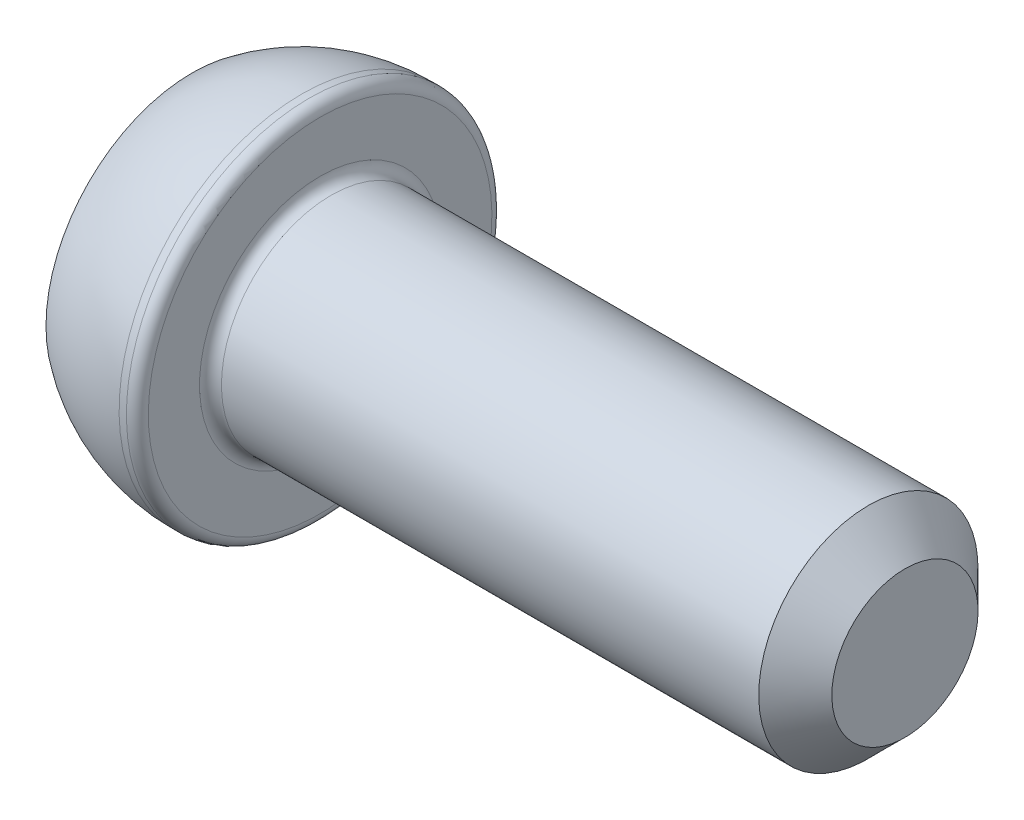
ISO-10303-21;
HEADER;
FILE_DESCRIPTION(('STEP AP214'),'2;1');
FILE_NAME('part.step','',(''),(''),'','','');
FILE_SCHEMA(('AUTOMOTIVE_DESIGN { 1 0 10303 214 1 1 1 1 }'));
ENDSEC;
DATA;
#1=APPLICATION_CONTEXT('core data for automotive mechanical design processes');
#2=APPLICATION_PROTOCOL_DEFINITION('international standard','automotive_design',2000,#1);
#3=PRODUCT_CONTEXT('',#1,'mechanical');
#4=PRODUCT('Part','Part','',(#3));
#5=PRODUCT_RELATED_PRODUCT_CATEGORY('part','',(#4));
#6=PRODUCT_DEFINITION_FORMATION('','',#4);
#7=PRODUCT_DEFINITION_CONTEXT('part definition',#1,'design');
#8=PRODUCT_DEFINITION('design','',#6,#7);
#9=PRODUCT_DEFINITION_SHAPE('','',#8);
#10=(LENGTH_UNIT() NAMED_UNIT(*) SI_UNIT(.MILLI.,.METRE.));
#11=(NAMED_UNIT(*) PLANE_ANGLE_UNIT() SI_UNIT($,.RADIAN.));
#12=(NAMED_UNIT(*) SI_UNIT($,.STERADIAN.) SOLID_ANGLE_UNIT());
#13=UNCERTAINTY_MEASURE_WITH_UNIT(LENGTH_MEASURE(1.E-05),#10,'distance_accuracy_value','');
#14=(GEOMETRIC_REPRESENTATION_CONTEXT(3) GLOBAL_UNCERTAINTY_ASSIGNED_CONTEXT((#13)) GLOBAL_UNIT_ASSIGNED_CONTEXT((#10,
#11,#12)) REPRESENTATION_CONTEXT('',''));
#15=CARTESIAN_POINT('',(0.,0.,0.));
#16=DIRECTION('',(0.,0.,1.));
#17=DIRECTION('',(1.,0.,0.));
#18=AXIS2_PLACEMENT_3D('',#15,#16,#17);
#19=CARTESIAN_POINT('',(0.,0.,0.));
#20=DIRECTION('',(-1.,0.,0.));
#21=DIRECTION('',(0.,-1.,0.));
#22=AXIS2_PLACEMENT_3D('',#19,#20,#21);
#23=PLANE('',#22);
#24=DIRECTION('',(0.,0.866025403784438,-0.5));
#25=VECTOR('',#24,1.);
#26=CARTESIAN_POINT('',(0.,0.,2.3094010767585));
#27=LINE('',#26,#25);
#28=CARTESIAN_POINT('',(0.,0.,2.3094010767585));
#29=VERTEX_POINT('',#28);
#30=CARTESIAN_POINT('',(0.,2.,1.15470053837925));
#31=VERTEX_POINT('',#30);
#32=EDGE_CURVE('E54',#29,#31,#27,.T.);
#33=ORIENTED_EDGE('',*,*,#32,.F.);
#34=DIRECTION('',(0.,0.866025403784439,0.5));
#35=VECTOR('',#34,1.);
#36=CARTESIAN_POINT('',(0.,-2.,1.15470053837925));
#37=LINE('',#36,#35);
#38=CARTESIAN_POINT('',(0.,-2.,1.15470053837925));
#39=VERTEX_POINT('',#38);
#40=EDGE_CURVE('E137',#39,#29,#37,.T.);
#41=ORIENTED_EDGE('',*,*,#40,.F.);
#42=DIRECTION('',(0.,0.,1.));
#43=VECTOR('',#42,1.);
#44=CARTESIAN_POINT('',(0.,-2.,-1.15470053837925));
#45=LINE('',#44,#43);
#46=CARTESIAN_POINT('',(0.,-2.,-1.15470053837925));
#47=VERTEX_POINT('',#46);
#48=EDGE_CURVE('E135',#47,#39,#45,.T.);
#49=ORIENTED_EDGE('',*,*,#48,.F.);
#50=DIRECTION('',(0.,-0.866025403784439,0.5));
#51=VECTOR('',#50,1.);
#52=CARTESIAN_POINT('',(0.,0.,-2.3094010767585));
#53=LINE('',#52,#51);
#54=CARTESIAN_POINT('',(0.,0.,-2.3094010767585));
#55=VERTEX_POINT('',#54);
#56=EDGE_CURVE('E102',#55,#47,#53,.T.);
#57=ORIENTED_EDGE('',*,*,#56,.F.);
#58=DIRECTION('',(0.,-0.866025403784439,-0.5));
#59=VECTOR('',#58,1.);
#60=CARTESIAN_POINT('',(0.,2.,-1.15470053837925));
#61=LINE('',#60,#59);
#62=CARTESIAN_POINT('',(0.,2.,-1.15470053837925));
#63=VERTEX_POINT('',#62);
#64=EDGE_CURVE('E131',#63,#55,#61,.T.);
#65=ORIENTED_EDGE('',*,*,#64,.F.);
#66=DIRECTION('',(0.,0.,-1.));
#67=VECTOR('',#66,1.);
#68=CARTESIAN_POINT('',(0.,2.,1.15470053837925));
#69=LINE('',#68,#67);
#70=EDGE_CURVE('E128',#31,#63,#69,.T.);
#71=ORIENTED_EDGE('',*,*,#70,.F.);
#72=EDGE_LOOP('',(#33,#41,#49,#57,#65,#71));
#73=FACE_BOUND('',#72,.T.);
#74=CARTESIAN_POINT('',(0.,0.,0.));
#75=DIRECTION('',(1.,0.,0.));
#76=DIRECTION('',(0.,1.,0.));
#77=AXIS2_PLACEMENT_3D('',#74,#75,#76);
#78=CIRCLE('',#77,4.);
#79=CARTESIAN_POINT('',(0.,4.,0.));
#80=VERTEX_POINT('',#79);
#81=EDGE_CURVE('E149',#80,#80,#78,.T.);
#82=ORIENTED_EDGE('',*,*,#81,.F.);
#83=EDGE_LOOP('',(#82));
#84=FACE_BOUND('',#83,.T.);
#85=ADVANCED_FACE('F38',(#73,#84),#23,.T.);
#86=CARTESIAN_POINT('',(3.,0.,0.));
#87=DIRECTION('',(1.,0.,0.));
#88=DIRECTION('',(0.,1.,0.));
#89=AXIS2_PLACEMENT_3D('',#86,#87,#88);
#90=SPHERICAL_SURFACE('',#89,5.);
#91=ORIENTED_EDGE('',*,*,#81,.T.);
#92=EDGE_LOOP('',(#91));
#93=FACE_BOUND('',#92,.T.);
#94=CARTESIAN_POINT('',(3.,0.,0.));
#95=DIRECTION('',(1.,0.,0.));
#96=DIRECTION('',(0.,1.,0.));
#97=AXIS2_PLACEMENT_3D('',#94,#95,#96);
#98=CIRCLE('',#97,5.);
#99=CARTESIAN_POINT('',(3.,5.,0.));
#100=VERTEX_POINT('',#99);
#101=EDGE_CURVE('E141',#100,#100,#98,.T.);
#102=ORIENTED_EDGE('',*,*,#101,.F.);
#103=EDGE_LOOP('',(#102));
#104=FACE_BOUND('',#103,.T.);
#105=ADVANCED_FACE('F178',(#93,#104),#90,.T.);
#106=CARTESIAN_POINT('',(19.5,0.,0.));
#107=DIRECTION('',(1.,0.,0.));
#108=DIRECTION('',(0.,1.,0.));
#109=AXIS2_PLACEMENT_3D('',#106,#107,#108);
#110=CYLINDRICAL_SURFACE('',#109,5.);
#111=CARTESIAN_POINT('',(3.2,0.,0.));
#112=DIRECTION('',(1.,0.,0.));
#113=DIRECTION('',(0.,1.,0.));
#114=AXIS2_PLACEMENT_3D('',#111,#112,#113);
#115=CIRCLE('',#114,5.);
#116=CARTESIAN_POINT('',(3.2,5.,0.));
#117=VERTEX_POINT('',#116);
#118=EDGE_CURVE('E161',#117,#117,#115,.F.);
#119=ORIENTED_EDGE('',*,*,#118,.T.);
#120=EDGE_LOOP('',(#119));
#121=FACE_BOUND('',#120,.T.);
#122=ORIENTED_EDGE('',*,*,#101,.T.);
#123=EDGE_LOOP('',(#122));
#124=FACE_BOUND('',#123,.T.);
#125=ADVANCED_FACE('F184',(#121,#124),#110,.T.);
#126=CARTESIAN_POINT('',(3.5,5.,0.));
#127=DIRECTION('',(1.,0.,0.));
#128=DIRECTION('',(0.,1.,0.));
#129=AXIS2_PLACEMENT_3D('',#126,#127,#128);
#130=PLANE('',#129);
#131=CARTESIAN_POINT('',(3.5,0.,0.));
#132=DIRECTION('',(1.,0.,0.));
#133=DIRECTION('',(0.,1.,0.));
#134=AXIS2_PLACEMENT_3D('',#131,#132,#133);
#135=CIRCLE('',#134,3.3);
#136=CARTESIAN_POINT('',(3.5,3.3,0.));
#137=VERTEX_POINT('',#136);
#138=EDGE_CURVE('E158',#137,#137,#135,.F.);
#139=ORIENTED_EDGE('',*,*,#138,.T.);
#140=EDGE_LOOP('',(#139));
#141=FACE_BOUND('',#140,.T.);
#142=CARTESIAN_POINT('',(3.5,0.,0.));
#143=DIRECTION('',(1.,0.,0.));
#144=DIRECTION('',(0.,1.,0.));
#145=AXIS2_PLACEMENT_3D('',#142,#143,#144);
#146=CIRCLE('',#145,4.7);
#147=CARTESIAN_POINT('',(3.5,4.7,0.));
#148=VERTEX_POINT('',#147);
#149=EDGE_CURVE('E155',#148,#148,#146,.T.);
#150=ORIENTED_EDGE('',*,*,#149,.T.);
#151=EDGE_LOOP('',(#150));
#152=FACE_BOUND('',#151,.T.);
#153=ADVANCED_FACE('F203',(#141,#152),#130,.T.);
#154=CARTESIAN_POINT('',(19.5,0.,0.));
#155=DIRECTION('',(1.,0.,0.));
#156=DIRECTION('',(0.,1.,0.));
#157=AXIS2_PLACEMENT_3D('',#154,#155,#156);
#158=CYLINDRICAL_SURFACE('',#157,3.);
#159=CARTESIAN_POINT('',(18.5,0.,0.));
#160=DIRECTION('',(1.,0.,0.));
#161=DIRECTION('',(0.,1.,0.));
#162=AXIS2_PLACEMENT_3D('',#159,#160,#161);
#163=CIRCLE('',#162,3.);
#164=CARTESIAN_POINT('',(18.5,3.,0.));
#165=VERTEX_POINT('',#164);
#166=EDGE_CURVE('E11',#165,#165,#163,.F.);
#167=ORIENTED_EDGE('',*,*,#166,.T.);
#168=EDGE_LOOP('',(#167));
#169=FACE_BOUND('',#168,.T.);
#170=CARTESIAN_POINT('',(3.8,0.,0.));
#171=DIRECTION('',(1.,0.,0.));
#172=DIRECTION('',(0.,1.,0.));
#173=AXIS2_PLACEMENT_3D('',#170,#171,#172);
#174=CIRCLE('',#173,3.);
#175=CARTESIAN_POINT('',(3.8,3.,0.));
#176=VERTEX_POINT('',#175);
#177=EDGE_CURVE('E152',#176,#176,#174,.T.);
#178=ORIENTED_EDGE('',*,*,#177,.T.);
#179=EDGE_LOOP('',(#178));
#180=FACE_BOUND('',#179,.T.);
#181=ADVANCED_FACE('F201',(#169,#180),#158,.T.);
#182=CARTESIAN_POINT('',(19.5,3.,0.));
#183=DIRECTION('',(1.,0.,0.));
#184=DIRECTION('',(0.,1.,0.));
#185=AXIS2_PLACEMENT_3D('',#182,#183,#184);
#186=PLANE('',#185);
#187=CARTESIAN_POINT('',(19.5,0.,0.));
#188=DIRECTION('',(1.,0.,0.));
#189=DIRECTION('',(0.,1.,0.));
#190=AXIS2_PLACEMENT_3D('',#187,#188,#189);
#191=CIRCLE('',#190,2.);
#192=CARTESIAN_POINT('',(19.5,2.,0.));
#193=VERTEX_POINT('',#192);
#194=EDGE_CURVE('E47',#193,#193,#191,.T.);
#195=ORIENTED_EDGE('',*,*,#194,.T.);
#196=EDGE_LOOP('',(#195));
#197=FACE_BOUND('',#196,.T.);
#198=ADVANCED_FACE('F166',(#197),#186,.T.);
#199=CARTESIAN_POINT('',(2.,0.,2.3094010767585));
#200=DIRECTION('',(0.,0.5,0.866025403784439));
#201=DIRECTION('',(0.,-0.866025403784438,0.5));
#202=AXIS2_PLACEMENT_3D('',#199,#200,#201);
#203=PLANE('',#202);
#204=ORIENTED_EDGE('',*,*,#32,.T.);
#205=DIRECTION('',(-1.,0.,0.));
#206=VECTOR('',#205,1.);
#207=CARTESIAN_POINT('',(2.,2.,1.15470053837925));
#208=LINE('',#207,#206);
#209=CARTESIAN_POINT('',(2.,2.,1.15470053837925));
#210=VERTEX_POINT('',#209);
#211=EDGE_CURVE('E84',#210,#31,#208,.T.);
#212=ORIENTED_EDGE('',*,*,#211,.F.);
#213=DIRECTION('',(0.,0.866025403784438,-0.5));
#214=VECTOR('',#213,1.);
#215=CARTESIAN_POINT('',(2.,0.,2.3094010767585));
#216=LINE('',#215,#214);
#217=CARTESIAN_POINT('',(2.,0.,2.3094010767585));
#218=VERTEX_POINT('',#217);
#219=EDGE_CURVE('E139',#218,#210,#216,.T.);
#220=ORIENTED_EDGE('',*,*,#219,.F.);
#221=DIRECTION('',(-1.,0.,0.));
#222=VECTOR('',#221,1.);
#223=CARTESIAN_POINT('',(2.,0.,2.3094010767585));
#224=LINE('',#223,#222);
#225=EDGE_CURVE('E62',#218,#29,#224,.T.);
#226=ORIENTED_EDGE('',*,*,#225,.T.);
#227=EDGE_LOOP('',(#204,#212,#220,#226));
#228=FACE_BOUND('',#227,.T.);
#229=ADVANCED_FACE('F210',(#228),#203,.F.);
#230=CARTESIAN_POINT('',(2.,-2.,1.15470053837925));
#231=DIRECTION('',(0.,-0.5,0.866025403784439));
#232=DIRECTION('',(0.,-0.866025403784439,-0.5));
#233=AXIS2_PLACEMENT_3D('',#230,#231,#232);
#234=PLANE('',#233);
#235=ORIENTED_EDGE('',*,*,#40,.T.);
#236=ORIENTED_EDGE('',*,*,#225,.F.);
#237=DIRECTION('',(0.,0.866025403784439,0.5));
#238=VECTOR('',#237,1.);
#239=CARTESIAN_POINT('',(2.,-2.,1.15470053837925));
#240=LINE('',#239,#238);
#241=CARTESIAN_POINT('',(2.,-2.,1.15470053837925));
#242=VERTEX_POINT('',#241);
#243=EDGE_CURVE('E114',#242,#218,#240,.T.);
#244=ORIENTED_EDGE('',*,*,#243,.F.);
#245=DIRECTION('',(-1.,0.,0.));
#246=VECTOR('',#245,1.);
#247=CARTESIAN_POINT('',(2.,-2.,1.15470053837925));
#248=LINE('',#247,#246);
#249=EDGE_CURVE('E106',#242,#39,#248,.T.);
#250=ORIENTED_EDGE('',*,*,#249,.T.);
#251=EDGE_LOOP('',(#235,#236,#244,#250));
#252=FACE_BOUND('',#251,.T.);
#253=ADVANCED_FACE('F269',(#252),#234,.F.);
#254=CARTESIAN_POINT('',(2.,-2.,-1.15470053837925));
#255=DIRECTION('',(0.,-1.,0.));
#256=DIRECTION('',(0.,0.,-1.));
#257=AXIS2_PLACEMENT_3D('',#254,#255,#256);
#258=PLANE('',#257);
#259=ORIENTED_EDGE('',*,*,#48,.T.);
#260=ORIENTED_EDGE('',*,*,#249,.F.);
#261=DIRECTION('',(0.,0.,1.));
#262=VECTOR('',#261,1.);
#263=CARTESIAN_POINT('',(2.,-2.,-1.15470053837925));
#264=LINE('',#263,#262);
#265=CARTESIAN_POINT('',(2.,-2.,-1.15470053837925));
#266=VERTEX_POINT('',#265);
#267=EDGE_CURVE('E110',#266,#242,#264,.T.);
#268=ORIENTED_EDGE('',*,*,#267,.F.);
#269=DIRECTION('',(-1.,0.,0.));
#270=VECTOR('',#269,1.);
#271=CARTESIAN_POINT('',(2.,-2.,-1.15470053837925));
#272=LINE('',#271,#270);
#273=EDGE_CURVE('E95',#266,#47,#272,.T.);
#274=ORIENTED_EDGE('',*,*,#273,.T.);
#275=EDGE_LOOP('',(#259,#260,#268,#274));
#276=FACE_BOUND('',#275,.T.);
#277=ADVANCED_FACE('F111',(#276),#258,.F.);
#278=CARTESIAN_POINT('',(2.,0.,-2.3094010767585));
#279=DIRECTION('',(0.,-0.5,-0.866025403784439));
#280=DIRECTION('',(0.,0.866025403784439,-0.5));
#281=AXIS2_PLACEMENT_3D('',#278,#279,#280);
#282=PLANE('',#281);
#283=ORIENTED_EDGE('',*,*,#56,.T.);
#284=ORIENTED_EDGE('',*,*,#273,.F.);
#285=DIRECTION('',(0.,-0.866025403784439,0.5));
#286=VECTOR('',#285,1.);
#287=CARTESIAN_POINT('',(2.,0.,-2.3094010767585));
#288=LINE('',#287,#286);
#289=CARTESIAN_POINT('',(2.,0.,-2.3094010767585));
#290=VERTEX_POINT('',#289);
#291=EDGE_CURVE('E99',#290,#266,#288,.T.);
#292=ORIENTED_EDGE('',*,*,#291,.F.);
#293=DIRECTION('',(-1.,0.,0.));
#294=VECTOR('',#293,1.);
#295=CARTESIAN_POINT('',(2.,0.,-2.3094010767585));
#296=LINE('',#295,#294);
#297=EDGE_CURVE('E107',#290,#55,#296,.T.);
#298=ORIENTED_EDGE('',*,*,#297,.T.);
#299=EDGE_LOOP('',(#283,#284,#292,#298));
#300=FACE_BOUND('',#299,.T.);
#301=ADVANCED_FACE('F97',(#300),#282,.F.);
#302=CARTESIAN_POINT('',(2.,2.,-1.15470053837925));
#303=DIRECTION('',(0.,0.5,-0.866025403784439));
#304=DIRECTION('',(0.,0.866025403784439,0.5));
#305=AXIS2_PLACEMENT_3D('',#302,#303,#304);
#306=PLANE('',#305);
#307=ORIENTED_EDGE('',*,*,#64,.T.);
#308=ORIENTED_EDGE('',*,*,#297,.F.);
#309=DIRECTION('',(0.,-0.866025403784439,-0.5));
#310=VECTOR('',#309,1.);
#311=CARTESIAN_POINT('',(2.,2.,-1.15470053837925));
#312=LINE('',#311,#310);
#313=CARTESIAN_POINT('',(2.,2.,-1.15470053837925));
#314=VERTEX_POINT('',#313);
#315=EDGE_CURVE('E120',#314,#290,#312,.T.);
#316=ORIENTED_EDGE('',*,*,#315,.F.);
#317=DIRECTION('',(-1.,0.,0.));
#318=VECTOR('',#317,1.);
#319=CARTESIAN_POINT('',(2.,2.,-1.15470053837925));
#320=LINE('',#319,#318);
#321=EDGE_CURVE('E144',#314,#63,#320,.T.);
#322=ORIENTED_EDGE('',*,*,#321,.T.);
#323=EDGE_LOOP('',(#307,#308,#316,#322));
#324=FACE_BOUND('',#323,.T.);
#325=ADVANCED_FACE('F286',(#324),#306,.F.);
#326=CARTESIAN_POINT('',(2.,2.,1.15470053837925));
#327=DIRECTION('',(0.,1.,0.));
#328=DIRECTION('',(0.,0.,1.));
#329=AXIS2_PLACEMENT_3D('',#326,#327,#328);
#330=PLANE('',#329);
#331=ORIENTED_EDGE('',*,*,#70,.T.);
#332=ORIENTED_EDGE('',*,*,#321,.F.);
#333=DIRECTION('',(0.,0.,-1.));
#334=VECTOR('',#333,1.);
#335=CARTESIAN_POINT('',(2.,2.,1.15470053837925));
#336=LINE('',#335,#334);
#337=EDGE_CURVE('E122',#210,#314,#336,.T.);
#338=ORIENTED_EDGE('',*,*,#337,.F.);
#339=ORIENTED_EDGE('',*,*,#211,.T.);
#340=EDGE_LOOP('',(#331,#332,#338,#339));
#341=FACE_BOUND('',#340,.T.);
#342=ADVANCED_FACE('F195',(#341),#330,.F.);
#343=CARTESIAN_POINT('',(2.,0.,0.));
#344=DIRECTION('',(-1.,0.,0.));
#345=DIRECTION('',(0.,0.,1.));
#346=AXIS2_PLACEMENT_3D('',#343,#344,#345);
#347=PLANE('',#346);
#348=ORIENTED_EDGE('',*,*,#219,.T.);
#349=ORIENTED_EDGE('',*,*,#337,.T.);
#350=ORIENTED_EDGE('',*,*,#315,.T.);
#351=ORIENTED_EDGE('',*,*,#291,.T.);
#352=ORIENTED_EDGE('',*,*,#267,.T.);
#353=ORIENTED_EDGE('',*,*,#243,.T.);
#354=EDGE_LOOP('',(#348,#349,#350,#351,#352,#353));
#355=FACE_BOUND('',#354,.T.);
#356=ADVANCED_FACE('F117',(#355),#347,.T.);
#357=CARTESIAN_POINT('',(3.8,0.,0.));
#358=DIRECTION('',(1.,0.,0.));
#359=DIRECTION('',(0.,1.,0.));
#360=AXIS2_PLACEMENT_3D('',#357,#358,#359);
#361=TOROIDAL_SURFACE('',#360,3.3,0.3);
#362=ORIENTED_EDGE('',*,*,#138,.F.);
#363=EDGE_LOOP('',(#362));
#364=FACE_BOUND('',#363,.T.);
#365=ORIENTED_EDGE('',*,*,#177,.F.);
#366=EDGE_LOOP('',(#365));
#367=FACE_BOUND('',#366,.T.);
#368=ADVANCED_FACE('F174',(#364,#367),#361,.F.);
#369=CARTESIAN_POINT('',(3.2,0.,0.));
#370=DIRECTION('',(1.,0.,0.));
#371=DIRECTION('',(0.,1.,0.));
#372=AXIS2_PLACEMENT_3D('',#369,#370,#371);
#373=TOROIDAL_SURFACE('',#372,4.7,0.3);
#374=ORIENTED_EDGE('',*,*,#118,.F.);
#375=EDGE_LOOP('',(#374));
#376=FACE_BOUND('',#375,.T.);
#377=ORIENTED_EDGE('',*,*,#149,.F.);
#378=EDGE_LOOP('',(#377));
#379=FACE_BOUND('',#378,.T.);
#380=ADVANCED_FACE('F169',(#376,#379),#373,.T.);
#381=CARTESIAN_POINT('',(19.5,0.,0.));
#382=DIRECTION('',(-1.,0.,0.));
#383=DIRECTION('',(0.,-1.,0.));
#384=AXIS2_PLACEMENT_3D('',#381,#382,#383);
#385=CONICAL_SURFACE('',#384,2.,0.785398163397447);
#386=ORIENTED_EDGE('',*,*,#166,.F.);
#387=EDGE_LOOP('',(#386));
#388=FACE_BOUND('',#387,.T.);
#389=ORIENTED_EDGE('',*,*,#194,.F.);
#390=EDGE_LOOP('',(#389));
#391=FACE_BOUND('',#390,.T.);
#392=ADVANCED_FACE('F41',(#388,#391),#385,.T.);
#393=CLOSED_SHELL('',(#85,#105,#125,#153,#181,#198,#229,#253,#277,#301,#325,#342,#356,#368,#380,#392));
#394=MANIFOLD_SOLID_BREP('B2',#393);
#395=ADVANCED_BREP_SHAPE_REPRESENTATION('',(#18,#394),#14);
#396=SHAPE_DEFINITION_REPRESENTATION(#9,#395);
ENDSEC;
END-ISO-10303-21;
